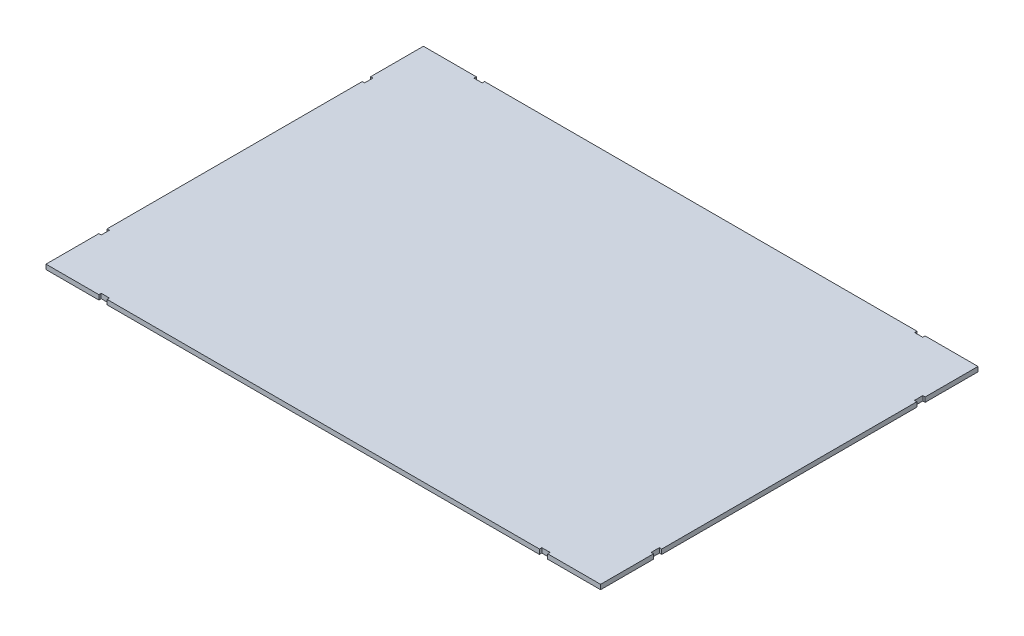
ISO-10303-21;
HEADER;
FILE_DESCRIPTION(('STEP AP214'),'2;1');
FILE_NAME('part.step','',(''),(''),'','','');
FILE_SCHEMA(('AUTOMOTIVE_DESIGN { 1 0 10303 214 1 1 1 1 }'));
ENDSEC;
DATA;
#1=APPLICATION_CONTEXT('core data for automotive mechanical design processes');
#2=APPLICATION_PROTOCOL_DEFINITION('international standard','automotive_design',2000,#1);
#3=PRODUCT_CONTEXT('',#1,'mechanical');
#4=PRODUCT('Part','Part','',(#3));
#5=PRODUCT_RELATED_PRODUCT_CATEGORY('part','',(#4));
#6=PRODUCT_DEFINITION_FORMATION('','',#4);
#7=PRODUCT_DEFINITION_CONTEXT('part definition',#1,'design');
#8=PRODUCT_DEFINITION('design','',#6,#7);
#9=PRODUCT_DEFINITION_SHAPE('','',#8);
#10=(LENGTH_UNIT() NAMED_UNIT(*) SI_UNIT(.MILLI.,.METRE.));
#11=(NAMED_UNIT(*) PLANE_ANGLE_UNIT() SI_UNIT($,.RADIAN.));
#12=(NAMED_UNIT(*) SI_UNIT($,.STERADIAN.) SOLID_ANGLE_UNIT());
#13=UNCERTAINTY_MEASURE_WITH_UNIT(LENGTH_MEASURE(1.E-05),#10,'distance_accuracy_value','');
#14=(GEOMETRIC_REPRESENTATION_CONTEXT(3) GLOBAL_UNCERTAINTY_ASSIGNED_CONTEXT((#13)) GLOBAL_UNIT_ASSIGNED_CONTEXT((#10,
#11,#12)) REPRESENTATION_CONTEXT('',''));
#15=CARTESIAN_POINT('',(0.,0.,0.));
#16=DIRECTION('',(0.,0.,1.));
#17=DIRECTION('',(1.,0.,0.));
#18=AXIS2_PLACEMENT_3D('',#15,#16,#17);
#19=CARTESIAN_POINT('',(469.5,8.,319.5));
#20=DIRECTION('',(-1.,0.,0.));
#21=DIRECTION('',(0.,0.,1.));
#22=AXIS2_PLACEMENT_3D('',#19,#20,#21);
#23=PLANE('',#22);
#24=DIRECTION('',(0.,0.,-1.));
#25=VECTOR('',#24,1.);
#26=CARTESIAN_POINT('',(469.5,0.,319.5));
#27=LINE('',#26,#25);
#28=CARTESIAN_POINT('',(469.5,0.,319.5));
#29=VERTEX_POINT('',#28);
#30=CARTESIAN_POINT('',(469.5,0.,230.));
#31=VERTEX_POINT('',#30);
#32=EDGE_CURVE('E487',#29,#31,#27,.T.);
#33=ORIENTED_EDGE('',*,*,#32,.T.);
#34=DIRECTION('',(0.,1.,0.));
#35=VECTOR('',#34,1.);
#36=CARTESIAN_POINT('',(469.5,8.,230.));
#37=LINE('',#36,#35);
#38=CARTESIAN_POINT('',(469.5,8.,230.));
#39=VERTEX_POINT('',#38);
#40=EDGE_CURVE('E278',#31,#39,#37,.T.);
#41=ORIENTED_EDGE('',*,*,#40,.T.);
#42=DIRECTION('',(0.,0.,-1.));
#43=VECTOR('',#42,1.);
#44=CARTESIAN_POINT('',(469.5,8.,319.5));
#45=LINE('',#44,#43);
#46=CARTESIAN_POINT('',(469.5,8.,319.5));
#47=VERTEX_POINT('',#46);
#48=EDGE_CURVE('E466',#47,#39,#45,.T.);
#49=ORIENTED_EDGE('',*,*,#48,.F.);
#50=DIRECTION('',(0.,-1.,0.));
#51=VECTOR('',#50,1.);
#52=CARTESIAN_POINT('',(469.5,8.,319.5));
#53=LINE('',#52,#51);
#54=EDGE_CURVE('E485',#47,#29,#53,.T.);
#55=ORIENTED_EDGE('',*,*,#54,.T.);
#56=EDGE_LOOP('',(#33,#41,#49,#55));
#57=FACE_BOUND('',#56,.T.);
#58=ADVANCED_FACE('F32',(#57),#23,.F.);
#59=CARTESIAN_POINT('',(469.5,8.,216.));
#60=VERTEX_POINT('',#59);
#61=CARTESIAN_POINT('',(469.5,8.,-216.));
#62=VERTEX_POINT('',#61);
#63=EDGE_CURVE('E470',#60,#62,#45,.T.);
#64=ORIENTED_EDGE('',*,*,#63,.F.);
#65=DIRECTION('',(0.,-1.,0.));
#66=VECTOR('',#65,1.);
#67=CARTESIAN_POINT('',(469.5,8.,216.));
#68=LINE('',#67,#66);
#69=CARTESIAN_POINT('',(469.5,0.,216.));
#70=VERTEX_POINT('',#69);
#71=EDGE_CURVE('E271',#60,#70,#68,.T.);
#72=ORIENTED_EDGE('',*,*,#71,.T.);
#73=CARTESIAN_POINT('',(469.5,0.,-216.));
#74=VERTEX_POINT('',#73);
#75=EDGE_CURVE('E490',#70,#74,#27,.T.);
#76=ORIENTED_EDGE('',*,*,#75,.T.);
#77=DIRECTION('',(0.,1.,0.));
#78=VECTOR('',#77,1.);
#79=CARTESIAN_POINT('',(469.5,8.,-216.));
#80=LINE('',#79,#78);
#81=EDGE_CURVE('E316',#74,#62,#80,.T.);
#82=ORIENTED_EDGE('',*,*,#81,.T.);
#83=EDGE_LOOP('',(#64,#72,#76,#82));
#84=FACE_BOUND('',#83,.T.);
#85=ADVANCED_FACE('F539',(#84),#23,.F.);
#86=CARTESIAN_POINT('',(-469.5,8.,319.5));
#87=DIRECTION('',(1.,0.,0.));
#88=DIRECTION('',(0.,0.,-1.));
#89=AXIS2_PLACEMENT_3D('',#86,#87,#88);
#90=PLANE('',#89);
#91=DIRECTION('',(0.,0.,1.));
#92=VECTOR('',#91,1.);
#93=CARTESIAN_POINT('',(-469.5,0.,319.5));
#94=LINE('',#93,#92);
#95=CARTESIAN_POINT('',(-469.5,0.,-319.5));
#96=VERTEX_POINT('',#95);
#97=CARTESIAN_POINT('',(-469.5,0.,-230.));
#98=VERTEX_POINT('',#97);
#99=EDGE_CURVE('E496',#96,#98,#94,.T.);
#100=ORIENTED_EDGE('',*,*,#99,.T.);
#101=DIRECTION('',(0.,1.,0.));
#102=VECTOR('',#101,1.);
#103=CARTESIAN_POINT('',(-469.5,8.,-230.));
#104=LINE('',#103,#102);
#105=CARTESIAN_POINT('',(-469.5,8.,-230.));
#106=VERTEX_POINT('',#105);
#107=EDGE_CURVE('E340',#98,#106,#104,.T.);
#108=ORIENTED_EDGE('',*,*,#107,.T.);
#109=DIRECTION('',(0.,0.,1.));
#110=VECTOR('',#109,1.);
#111=CARTESIAN_POINT('',(-469.5,8.,319.5));
#112=LINE('',#111,#110);
#113=CARTESIAN_POINT('',(-469.5,8.,-319.5));
#114=VERTEX_POINT('',#113);
#115=EDGE_CURVE('E477',#114,#106,#112,.T.);
#116=ORIENTED_EDGE('',*,*,#115,.F.);
#117=DIRECTION('',(0.,-1.,0.));
#118=VECTOR('',#117,1.);
#119=CARTESIAN_POINT('',(-469.5,8.,-319.5));
#120=LINE('',#119,#118);
#121=EDGE_CURVE('E510',#114,#96,#120,.T.);
#122=ORIENTED_EDGE('',*,*,#121,.T.);
#123=EDGE_LOOP('',(#100,#108,#116,#122));
#124=FACE_BOUND('',#123,.T.);
#125=ADVANCED_FACE('F579',(#124),#90,.F.);
#126=CARTESIAN_POINT('',(-469.5,8.,-319.5));
#127=DIRECTION('',(0.,0.,1.));
#128=DIRECTION('',(1.,0.,0.));
#129=AXIS2_PLACEMENT_3D('',#126,#127,#128);
#130=PLANE('',#129);
#131=DIRECTION('',(-1.,0.,0.));
#132=VECTOR('',#131,1.);
#133=CARTESIAN_POINT('',(-469.5,8.,-319.5));
#134=LINE('',#133,#132);
#135=CARTESIAN_POINT('',(366.,8.,-319.5));
#136=VERTEX_POINT('',#135);
#137=CARTESIAN_POINT('',(-366.,8.,-319.5));
#138=VERTEX_POINT('',#137);
#139=EDGE_CURVE('E476',#136,#138,#134,.T.);
#140=ORIENTED_EDGE('',*,*,#139,.F.);
#141=DIRECTION('',(0.,-1.,0.));
#142=VECTOR('',#141,1.);
#143=CARTESIAN_POINT('',(366.,8.,-319.5));
#144=LINE('',#143,#142);
#145=CARTESIAN_POINT('',(366.,0.,-319.5));
#146=VERTEX_POINT('',#145);
#147=EDGE_CURVE('E364',#136,#146,#144,.T.);
#148=ORIENTED_EDGE('',*,*,#147,.T.);
#149=DIRECTION('',(-1.,0.,0.));
#150=VECTOR('',#149,1.);
#151=CARTESIAN_POINT('',(-469.5,0.,-319.5));
#152=LINE('',#151,#150);
#153=CARTESIAN_POINT('',(-366.,0.,-319.5));
#154=VERTEX_POINT('',#153);
#155=EDGE_CURVE('E495',#146,#154,#152,.T.);
#156=ORIENTED_EDGE('',*,*,#155,.T.);
#157=DIRECTION('',(0.,1.,0.));
#158=VECTOR('',#157,1.);
#159=CARTESIAN_POINT('',(-366.,8.,-319.5));
#160=LINE('',#159,#158);
#161=EDGE_CURVE('E385',#154,#138,#160,.T.);
#162=ORIENTED_EDGE('',*,*,#161,.T.);
#163=EDGE_LOOP('',(#140,#148,#156,#162));
#164=FACE_BOUND('',#163,.T.);
#165=ADVANCED_FACE('F566',(#164),#130,.F.);
#166=CARTESIAN_POINT('',(-380.,8.,-319.5));
#167=VERTEX_POINT('',#166);
#168=EDGE_CURVE('E469',#167,#114,#134,.T.);
#169=ORIENTED_EDGE('',*,*,#168,.F.);
#170=DIRECTION('',(0.,-1.,0.));
#171=VECTOR('',#170,1.);
#172=CARTESIAN_POINT('',(-380.,8.,-319.5));
#173=LINE('',#172,#171);
#174=CARTESIAN_POINT('',(-380.,0.,-319.5));
#175=VERTEX_POINT('',#174);
#176=EDGE_CURVE('E389',#167,#175,#173,.T.);
#177=ORIENTED_EDGE('',*,*,#176,.T.);
#178=EDGE_CURVE('E489',#175,#96,#152,.T.);
#179=ORIENTED_EDGE('',*,*,#178,.T.);
#180=ORIENTED_EDGE('',*,*,#121,.F.);
#181=EDGE_LOOP('',(#169,#177,#179,#180));
#182=FACE_BOUND('',#181,.T.);
#183=ADVANCED_FACE('F575',(#182),#130,.F.);
#184=CARTESIAN_POINT('',(-469.5,8.,230.));
#185=VERTEX_POINT('',#184);
#186=CARTESIAN_POINT('',(-469.5,8.,319.5));
#187=VERTEX_POINT('',#186);
#188=EDGE_CURVE('E475',#185,#187,#112,.T.);
#189=ORIENTED_EDGE('',*,*,#188,.F.);
#190=DIRECTION('',(0.,-1.,0.));
#191=VECTOR('',#190,1.);
#192=CARTESIAN_POINT('',(-469.5,8.,230.));
#193=LINE('',#192,#191);
#194=CARTESIAN_POINT('',(-469.5,0.,230.));
#195=VERTEX_POINT('',#194);
#196=EDGE_CURVE('E414',#185,#195,#193,.T.);
#197=ORIENTED_EDGE('',*,*,#196,.T.);
#198=CARTESIAN_POINT('',(-469.5,0.,319.5));
#199=VERTEX_POINT('',#198);
#200=EDGE_CURVE('E494',#195,#199,#94,.T.);
#201=ORIENTED_EDGE('',*,*,#200,.T.);
#202=DIRECTION('',(0.,-1.,0.));
#203=VECTOR('',#202,1.);
#204=CARTESIAN_POINT('',(-469.5,8.,319.5));
#205=LINE('',#204,#203);
#206=EDGE_CURVE('E507',#187,#199,#205,.T.);
#207=ORIENTED_EDGE('',*,*,#206,.F.);
#208=EDGE_LOOP('',(#189,#197,#201,#207));
#209=FACE_BOUND('',#208,.T.);
#210=ADVANCED_FACE('F604',(#209),#90,.F.);
#211=CARTESIAN_POINT('',(-469.5,8.,319.5));
#212=DIRECTION('',(0.,0.,-1.));
#213=DIRECTION('',(-1.,0.,0.));
#214=AXIS2_PLACEMENT_3D('',#211,#212,#213);
#215=PLANE('',#214);
#216=DIRECTION('',(1.,0.,0.));
#217=VECTOR('',#216,1.);
#218=CARTESIAN_POINT('',(-469.5,8.,319.5));
#219=LINE('',#218,#217);
#220=CARTESIAN_POINT('',(380.,8.,319.5));
#221=VERTEX_POINT('',#220);
#222=EDGE_CURVE('E480',#221,#47,#219,.T.);
#223=ORIENTED_EDGE('',*,*,#222,.F.);
#224=DIRECTION('',(0.,-1.,0.));
#225=VECTOR('',#224,1.);
#226=CARTESIAN_POINT('',(380.,8.,319.5));
#227=LINE('',#226,#225);
#228=CARTESIAN_POINT('',(380.,0.,319.5));
#229=VERTEX_POINT('',#228);
#230=EDGE_CURVE('E438',#221,#229,#227,.T.);
#231=ORIENTED_EDGE('',*,*,#230,.T.);
#232=DIRECTION('',(1.,0.,0.));
#233=VECTOR('',#232,1.);
#234=CARTESIAN_POINT('',(-469.5,0.,319.5));
#235=LINE('',#234,#233);
#236=EDGE_CURVE('E499',#229,#29,#235,.T.);
#237=ORIENTED_EDGE('',*,*,#236,.T.);
#238=ORIENTED_EDGE('',*,*,#54,.F.);
#239=EDGE_LOOP('',(#223,#231,#237,#238));
#240=FACE_BOUND('',#239,.T.);
#241=ADVANCED_FACE('F632',(#240),#215,.F.);
#242=CARTESIAN_POINT('',(-366.,0.,319.5));
#243=VERTEX_POINT('',#242);
#244=CARTESIAN_POINT('',(366.,0.,319.5));
#245=VERTEX_POINT('',#244);
#246=EDGE_CURVE('E504',#243,#245,#235,.T.);
#247=ORIENTED_EDGE('',*,*,#246,.T.);
#248=DIRECTION('',(0.,1.,0.));
#249=VECTOR('',#248,1.);
#250=CARTESIAN_POINT('',(366.,8.,319.5));
#251=LINE('',#250,#249);
#252=CARTESIAN_POINT('',(366.,8.,319.5));
#253=VERTEX_POINT('',#252);
#254=EDGE_CURVE('E433',#245,#253,#251,.T.);
#255=ORIENTED_EDGE('',*,*,#254,.T.);
#256=CARTESIAN_POINT('',(-366.,8.,319.5));
#257=VERTEX_POINT('',#256);
#258=EDGE_CURVE('E486',#257,#253,#219,.T.);
#259=ORIENTED_EDGE('',*,*,#258,.F.);
#260=DIRECTION('',(0.,-1.,0.));
#261=VECTOR('',#260,1.);
#262=CARTESIAN_POINT('',(-366.,8.,319.5));
#263=LINE('',#262,#261);
#264=EDGE_CURVE('E462',#257,#243,#263,.T.);
#265=ORIENTED_EDGE('',*,*,#264,.T.);
#266=EDGE_LOOP('',(#247,#255,#259,#265));
#267=FACE_BOUND('',#266,.T.);
#268=ADVANCED_FACE('F625',(#267),#215,.F.);
#269=CARTESIAN_POINT('',(469.5,8.,-230.));
#270=VERTEX_POINT('',#269);
#271=CARTESIAN_POINT('',(469.5,8.,-319.5));
#272=VERTEX_POINT('',#271);
#273=EDGE_CURVE('E471',#270,#272,#45,.T.);
#274=ORIENTED_EDGE('',*,*,#273,.F.);
#275=DIRECTION('',(0.,-1.,0.));
#276=VECTOR('',#275,1.);
#277=CARTESIAN_POINT('',(469.5,8.,-230.));
#278=LINE('',#277,#276);
#279=CARTESIAN_POINT('',(469.5,0.,-230.));
#280=VERTEX_POINT('',#279);
#281=EDGE_CURVE('E312',#270,#280,#278,.T.);
#282=ORIENTED_EDGE('',*,*,#281,.T.);
#283=CARTESIAN_POINT('',(469.5,0.,-319.5));
#284=VERTEX_POINT('',#283);
#285=EDGE_CURVE('E465',#280,#284,#27,.T.);
#286=ORIENTED_EDGE('',*,*,#285,.T.);
#287=DIRECTION('',(0.,-1.,0.));
#288=VECTOR('',#287,1.);
#289=CARTESIAN_POINT('',(469.5,8.,-319.5));
#290=LINE('',#289,#288);
#291=EDGE_CURVE('E513',#272,#284,#290,.T.);
#292=ORIENTED_EDGE('',*,*,#291,.F.);
#293=EDGE_LOOP('',(#274,#282,#286,#292));
#294=FACE_BOUND('',#293,.T.);
#295=ADVANCED_FACE('F34',(#294),#23,.F.);
#296=CARTESIAN_POINT('',(380.,0.,-319.5));
#297=VERTEX_POINT('',#296);
#298=EDGE_CURVE('E491',#284,#297,#152,.T.);
#299=ORIENTED_EDGE('',*,*,#298,.T.);
#300=DIRECTION('',(0.,1.,0.));
#301=VECTOR('',#300,1.);
#302=CARTESIAN_POINT('',(380.,8.,-319.5));
#303=LINE('',#302,#301);
#304=CARTESIAN_POINT('',(380.,8.,-319.5));
#305=VERTEX_POINT('',#304);
#306=EDGE_CURVE('E360',#297,#305,#303,.T.);
#307=ORIENTED_EDGE('',*,*,#306,.T.);
#308=EDGE_CURVE('E472',#272,#305,#134,.T.);
#309=ORIENTED_EDGE('',*,*,#308,.F.);
#310=ORIENTED_EDGE('',*,*,#291,.T.);
#311=EDGE_LOOP('',(#299,#307,#309,#310));
#312=FACE_BOUND('',#311,.T.);
#313=ADVANCED_FACE('F551',(#312),#130,.F.);
#314=CARTESIAN_POINT('',(-469.5,8.,-216.));
#315=VERTEX_POINT('',#314);
#316=CARTESIAN_POINT('',(-469.5,8.,216.));
#317=VERTEX_POINT('',#316);
#318=EDGE_CURVE('E481',#315,#317,#112,.T.);
#319=ORIENTED_EDGE('',*,*,#318,.F.);
#320=DIRECTION('',(0.,-1.,0.));
#321=VECTOR('',#320,1.);
#322=CARTESIAN_POINT('',(-469.5,8.,-216.));
#323=LINE('',#322,#321);
#324=CARTESIAN_POINT('',(-469.5,0.,-216.));
#325=VERTEX_POINT('',#324);
#326=EDGE_CURVE('E335',#315,#325,#323,.T.);
#327=ORIENTED_EDGE('',*,*,#326,.T.);
#328=CARTESIAN_POINT('',(-469.5,0.,216.));
#329=VERTEX_POINT('',#328);
#330=EDGE_CURVE('E500',#325,#329,#94,.T.);
#331=ORIENTED_EDGE('',*,*,#330,.T.);
#332=DIRECTION('',(0.,1.,0.));
#333=VECTOR('',#332,1.);
#334=CARTESIAN_POINT('',(-469.5,8.,216.));
#335=LINE('',#334,#333);
#336=EDGE_CURVE('E410',#329,#317,#335,.T.);
#337=ORIENTED_EDGE('',*,*,#336,.T.);
#338=EDGE_LOOP('',(#319,#327,#331,#337));
#339=FACE_BOUND('',#338,.T.);
#340=ADVANCED_FACE('F595',(#339),#90,.F.);
#341=CARTESIAN_POINT('',(-380.,0.,319.5));
#342=VERTEX_POINT('',#341);
#343=EDGE_CURVE('E501',#199,#342,#235,.T.);
#344=ORIENTED_EDGE('',*,*,#343,.T.);
#345=DIRECTION('',(0.,1.,0.));
#346=VECTOR('',#345,1.);
#347=CARTESIAN_POINT('',(-380.,8.,319.5));
#348=LINE('',#347,#346);
#349=CARTESIAN_POINT('',(-380.,8.,319.5));
#350=VERTEX_POINT('',#349);
#351=EDGE_CURVE('E457',#342,#350,#348,.T.);
#352=ORIENTED_EDGE('',*,*,#351,.T.);
#353=EDGE_CURVE('E482',#187,#350,#219,.T.);
#354=ORIENTED_EDGE('',*,*,#353,.F.);
#355=ORIENTED_EDGE('',*,*,#206,.T.);
#356=EDGE_LOOP('',(#344,#352,#354,#355));
#357=FACE_BOUND('',#356,.T.);
#358=ADVANCED_FACE('F608',(#357),#215,.F.);
#359=CARTESIAN_POINT('',(0.,8.,0.));
#360=DIRECTION('',(0.,-1.,0.));
#361=DIRECTION('',(0.,0.,-1.));
#362=AXIS2_PLACEMENT_3D('',#359,#360,#361);
#363=PLANE('',#362);
#364=ORIENTED_EDGE('',*,*,#48,.T.);
#365=DIRECTION('',(1.,0.,0.));
#366=VECTOR('',#365,1.);
#367=CARTESIAN_POINT('',(473.5,8.,230.));
#368=LINE('',#367,#366);
#369=CARTESIAN_POINT('',(465.5,8.,230.));
#370=VERTEX_POINT('',#369);
#371=EDGE_CURVE('E286',#370,#39,#368,.T.);
#372=ORIENTED_EDGE('',*,*,#371,.F.);
#373=DIRECTION('',(0.,0.,1.));
#374=VECTOR('',#373,1.);
#375=CARTESIAN_POINT('',(465.5,8.,216.));
#376=LINE('',#375,#374);
#377=CARTESIAN_POINT('',(465.5,8.,216.));
#378=VERTEX_POINT('',#377);
#379=EDGE_CURVE('E268',#378,#370,#376,.T.);
#380=ORIENTED_EDGE('',*,*,#379,.F.);
#381=DIRECTION('',(-1.,0.,0.));
#382=VECTOR('',#381,1.);
#383=CARTESIAN_POINT('',(473.5,8.,216.));
#384=LINE('',#383,#382);
#385=EDGE_CURVE('E290',#60,#378,#384,.T.);
#386=ORIENTED_EDGE('',*,*,#385,.F.);
#387=ORIENTED_EDGE('',*,*,#63,.T.);
#388=DIRECTION('',(1.,0.,0.));
#389=VECTOR('',#388,1.);
#390=CARTESIAN_POINT('',(473.5,8.,-216.));
#391=LINE('',#390,#389);
#392=CARTESIAN_POINT('',(465.5,8.,-216.));
#393=VERTEX_POINT('',#392);
#394=EDGE_CURVE('E300',#393,#62,#391,.T.);
#395=ORIENTED_EDGE('',*,*,#394,.F.);
#396=DIRECTION('',(0.,0.,1.));
#397=VECTOR('',#396,1.);
#398=CARTESIAN_POINT('',(465.5,8.,-216.));
#399=LINE('',#398,#397);
#400=CARTESIAN_POINT('',(465.5,8.,-230.));
#401=VERTEX_POINT('',#400);
#402=EDGE_CURVE('E305',#401,#393,#399,.T.);
#403=ORIENTED_EDGE('',*,*,#402,.F.);
#404=DIRECTION('',(-1.,0.,0.));
#405=VECTOR('',#404,1.);
#406=CARTESIAN_POINT('',(473.5,8.,-230.));
#407=LINE('',#406,#405);
#408=EDGE_CURVE('E297',#270,#401,#407,.T.);
#409=ORIENTED_EDGE('',*,*,#408,.F.);
#410=ORIENTED_EDGE('',*,*,#273,.T.);
#411=ORIENTED_EDGE('',*,*,#308,.T.);
#412=DIRECTION('',(0.,0.,-1.));
#413=VECTOR('',#412,1.);
#414=CARTESIAN_POINT('',(380.,8.,-315.5));
#415=LINE('',#414,#413);
#416=CARTESIAN_POINT('',(380.,8.,-315.5));
#417=VERTEX_POINT('',#416);
#418=EDGE_CURVE('E354',#417,#305,#415,.T.);
#419=ORIENTED_EDGE('',*,*,#418,.F.);
#420=DIRECTION('',(1.,0.,0.));
#421=VECTOR('',#420,1.);
#422=CARTESIAN_POINT('',(380.,8.,-315.5));
#423=LINE('',#422,#421);
#424=CARTESIAN_POINT('',(366.,8.,-315.5));
#425=VERTEX_POINT('',#424);
#426=EDGE_CURVE('E343',#425,#417,#423,.T.);
#427=ORIENTED_EDGE('',*,*,#426,.F.);
#428=DIRECTION('',(0.,0.,1.));
#429=VECTOR('',#428,1.);
#430=CARTESIAN_POINT('',(366.,8.,-315.5));
#431=LINE('',#430,#429);
#432=EDGE_CURVE('E348',#136,#425,#431,.T.);
#433=ORIENTED_EDGE('',*,*,#432,.F.);
#434=ORIENTED_EDGE('',*,*,#139,.T.);
#435=DIRECTION('',(0.,0.,-1.));
#436=VECTOR('',#435,1.);
#437=CARTESIAN_POINT('',(-366.,8.,-315.5));
#438=LINE('',#437,#436);
#439=CARTESIAN_POINT('',(-366.,8.,-315.5));
#440=VERTEX_POINT('',#439);
#441=EDGE_CURVE('E378',#440,#138,#438,.T.);
#442=ORIENTED_EDGE('',*,*,#441,.F.);
#443=DIRECTION('',(1.,0.,0.));
#444=VECTOR('',#443,1.);
#445=CARTESIAN_POINT('',(-380.,8.,-315.5));
#446=LINE('',#445,#444);
#447=CARTESIAN_POINT('',(-380.,8.,-315.5));
#448=VERTEX_POINT('',#447);
#449=EDGE_CURVE('E367',#448,#440,#446,.T.);
#450=ORIENTED_EDGE('',*,*,#449,.F.);
#451=DIRECTION('',(0.,0.,1.));
#452=VECTOR('',#451,1.);
#453=CARTESIAN_POINT('',(-380.,8.,-315.5));
#454=LINE('',#453,#452);
#455=EDGE_CURVE('E372',#167,#448,#454,.T.);
#456=ORIENTED_EDGE('',*,*,#455,.F.);
#457=ORIENTED_EDGE('',*,*,#168,.T.);
#458=ORIENTED_EDGE('',*,*,#115,.T.);
#459=DIRECTION('',(-1.,0.,0.));
#460=VECTOR('',#459,1.);
#461=CARTESIAN_POINT('',(-473.5,8.,-230.));
#462=LINE('',#461,#460);
#463=CARTESIAN_POINT('',(-465.5,8.,-230.));
#464=VERTEX_POINT('',#463);
#465=EDGE_CURVE('E324',#464,#106,#462,.T.);
#466=ORIENTED_EDGE('',*,*,#465,.F.);
#467=DIRECTION('',(0.,0.,-1.));
#468=VECTOR('',#467,1.);
#469=CARTESIAN_POINT('',(-465.5,8.,-216.));
#470=LINE('',#469,#468);
#471=CARTESIAN_POINT('',(-465.5,8.,-216.));
#472=VERTEX_POINT('',#471);
#473=EDGE_CURVE('E329',#472,#464,#470,.T.);
#474=ORIENTED_EDGE('',*,*,#473,.F.);
#475=DIRECTION('',(1.,0.,0.));
#476=VECTOR('',#475,1.);
#477=CARTESIAN_POINT('',(-473.5,8.,-216.));
#478=LINE('',#477,#476);
#479=EDGE_CURVE('E319',#315,#472,#478,.T.);
#480=ORIENTED_EDGE('',*,*,#479,.F.);
#481=ORIENTED_EDGE('',*,*,#318,.T.);
#482=DIRECTION('',(-1.,0.,0.));
#483=VECTOR('',#482,1.);
#484=CARTESIAN_POINT('',(-473.5,8.,216.));
#485=LINE('',#484,#483);
#486=CARTESIAN_POINT('',(-465.5,8.,216.));
#487=VERTEX_POINT('',#486);
#488=EDGE_CURVE('E403',#487,#317,#485,.T.);
#489=ORIENTED_EDGE('',*,*,#488,.F.);
#490=DIRECTION('',(0.,0.,-1.));
#491=VECTOR('',#490,1.);
#492=CARTESIAN_POINT('',(-465.5,8.,216.));
#493=LINE('',#492,#491);
#494=CARTESIAN_POINT('',(-465.5,8.,230.));
#495=VERTEX_POINT('',#494);
#496=EDGE_CURVE('E392',#495,#487,#493,.T.);
#497=ORIENTED_EDGE('',*,*,#496,.F.);
#498=DIRECTION('',(1.,0.,0.));
#499=VECTOR('',#498,1.);
#500=CARTESIAN_POINT('',(-473.5,8.,230.));
#501=LINE('',#500,#499);
#502=EDGE_CURVE('E397',#185,#495,#501,.T.);
#503=ORIENTED_EDGE('',*,*,#502,.F.);
#504=ORIENTED_EDGE('',*,*,#188,.T.);
#505=ORIENTED_EDGE('',*,*,#353,.T.);
#506=DIRECTION('',(0.,0.,1.));
#507=VECTOR('',#506,1.);
#508=CARTESIAN_POINT('',(-380.,8.,315.5));
#509=LINE('',#508,#507);
#510=CARTESIAN_POINT('',(-380.,8.,315.5));
#511=VERTEX_POINT('',#510);
#512=EDGE_CURVE('E446',#511,#350,#509,.T.);
#513=ORIENTED_EDGE('',*,*,#512,.F.);
#514=DIRECTION('',(-1.,0.,0.));
#515=VECTOR('',#514,1.);
#516=CARTESIAN_POINT('',(-380.,8.,315.5));
#517=LINE('',#516,#515);
#518=CARTESIAN_POINT('',(-366.,8.,315.5));
#519=VERTEX_POINT('',#518);
#520=EDGE_CURVE('E451',#519,#511,#517,.T.);
#521=ORIENTED_EDGE('',*,*,#520,.F.);
#522=DIRECTION('',(0.,0.,-1.));
#523=VECTOR('',#522,1.);
#524=CARTESIAN_POINT('',(-366.,8.,315.5));
#525=LINE('',#524,#523);
#526=EDGE_CURVE('E441',#257,#519,#525,.T.);
#527=ORIENTED_EDGE('',*,*,#526,.F.);
#528=ORIENTED_EDGE('',*,*,#258,.T.);
#529=DIRECTION('',(0.,0.,1.));
#530=VECTOR('',#529,1.);
#531=CARTESIAN_POINT('',(366.,8.,315.5));
#532=LINE('',#531,#530);
#533=CARTESIAN_POINT('',(366.,8.,315.5));
#534=VERTEX_POINT('',#533);
#535=EDGE_CURVE('E422',#534,#253,#532,.T.);
#536=ORIENTED_EDGE('',*,*,#535,.F.);
#537=DIRECTION('',(-1.,0.,0.));
#538=VECTOR('',#537,1.);
#539=CARTESIAN_POINT('',(380.,8.,315.5));
#540=LINE('',#539,#538);
#541=CARTESIAN_POINT('',(380.,8.,315.5));
#542=VERTEX_POINT('',#541);
#543=EDGE_CURVE('E427',#542,#534,#540,.T.);
#544=ORIENTED_EDGE('',*,*,#543,.F.);
#545=DIRECTION('',(0.,0.,-1.));
#546=VECTOR('',#545,1.);
#547=CARTESIAN_POINT('',(380.,8.,315.5));
#548=LINE('',#547,#546);
#549=EDGE_CURVE('E417',#221,#542,#548,.T.);
#550=ORIENTED_EDGE('',*,*,#549,.F.);
#551=ORIENTED_EDGE('',*,*,#222,.T.);
#552=EDGE_LOOP('',(#364,#372,#380,#386,#387,#395,#403,#409,#410,#411,#419,#427,#433,#434,#442,
#450,#456,#457,#458,#466,#474,#480,#481,#489,#497,#503,#504,#505,#513,#521,#527,#528,#536,#544,
#550,#551));
#553=FACE_BOUND('',#552,.T.);
#554=ADVANCED_FACE('F546',(#553),#363,.F.);
#555=CARTESIAN_POINT('',(0.,0.,0.));
#556=DIRECTION('',(0.,-1.,0.));
#557=DIRECTION('',(0.,0.,-1.));
#558=AXIS2_PLACEMENT_3D('',#555,#556,#557);
#559=PLANE('',#558);
#560=DIRECTION('',(1.,0.,0.));
#561=VECTOR('',#560,1.);
#562=CARTESIAN_POINT('',(473.5,0.,230.));
#563=LINE('',#562,#561);
#564=CARTESIAN_POINT('',(465.5,0.,230.));
#565=VERTEX_POINT('',#564);
#566=EDGE_CURVE('E275',#565,#31,#563,.T.);
#567=ORIENTED_EDGE('',*,*,#566,.T.);
#568=ORIENTED_EDGE('',*,*,#32,.F.);
#569=ORIENTED_EDGE('',*,*,#236,.F.);
#570=DIRECTION('',(0.,0.,1.));
#571=VECTOR('',#570,1.);
#572=CARTESIAN_POINT('',(380.,0.,0.));
#573=LINE('',#572,#571);
#574=CARTESIAN_POINT('',(380.,0.,315.5));
#575=VERTEX_POINT('',#574);
#576=EDGE_CURVE('E518',#575,#229,#573,.T.);
#577=ORIENTED_EDGE('',*,*,#576,.F.);
#578=DIRECTION('',(-1.,0.,0.));
#579=VECTOR('',#578,1.);
#580=CARTESIAN_POINT('',(380.,0.,315.5));
#581=LINE('',#580,#579);
#582=CARTESIAN_POINT('',(366.,0.,315.5));
#583=VERTEX_POINT('',#582);
#584=EDGE_CURVE('E418',#575,#583,#581,.T.);
#585=ORIENTED_EDGE('',*,*,#584,.T.);
#586=DIRECTION('',(0.,0.,1.));
#587=VECTOR('',#586,1.);
#588=CARTESIAN_POINT('',(366.,0.,315.5));
#589=LINE('',#588,#587);
#590=EDGE_CURVE('E421',#583,#245,#589,.T.);
#591=ORIENTED_EDGE('',*,*,#590,.T.);
#592=ORIENTED_EDGE('',*,*,#246,.F.);
#593=DIRECTION('',(0.,0.,1.));
#594=VECTOR('',#593,1.);
#595=CARTESIAN_POINT('',(-366.,0.,0.));
#596=LINE('',#595,#594);
#597=CARTESIAN_POINT('',(-366.,0.,315.5));
#598=VERTEX_POINT('',#597);
#599=EDGE_CURVE('E516',#598,#243,#596,.T.);
#600=ORIENTED_EDGE('',*,*,#599,.F.);
#601=DIRECTION('',(-1.,0.,0.));
#602=VECTOR('',#601,1.);
#603=CARTESIAN_POINT('',(-380.,0.,315.5));
#604=LINE('',#603,#602);
#605=CARTESIAN_POINT('',(-380.,0.,315.5));
#606=VERTEX_POINT('',#605);
#607=EDGE_CURVE('E442',#598,#606,#604,.T.);
#608=ORIENTED_EDGE('',*,*,#607,.T.);
#609=DIRECTION('',(0.,0.,1.));
#610=VECTOR('',#609,1.);
#611=CARTESIAN_POINT('',(-380.,0.,315.5));
#612=LINE('',#611,#610);
#613=EDGE_CURVE('E445',#606,#342,#612,.T.);
#614=ORIENTED_EDGE('',*,*,#613,.T.);
#615=ORIENTED_EDGE('',*,*,#343,.F.);
#616=ORIENTED_EDGE('',*,*,#200,.F.);
#617=DIRECTION('',(-1.,0.,0.));
#618=VECTOR('',#617,1.);
#619=CARTESIAN_POINT('',(0.,0.,230.));
#620=LINE('',#619,#618);
#621=CARTESIAN_POINT('',(-465.5,0.,230.));
#622=VERTEX_POINT('',#621);
#623=EDGE_CURVE('E520',#622,#195,#620,.T.);
#624=ORIENTED_EDGE('',*,*,#623,.F.);
#625=DIRECTION('',(0.,0.,-1.));
#626=VECTOR('',#625,1.);
#627=CARTESIAN_POINT('',(-465.5,0.,216.));
#628=LINE('',#627,#626);
#629=CARTESIAN_POINT('',(-465.5,0.,216.));
#630=VERTEX_POINT('',#629);
#631=EDGE_CURVE('E393',#622,#630,#628,.T.);
#632=ORIENTED_EDGE('',*,*,#631,.T.);
#633=DIRECTION('',(-1.,0.,0.));
#634=VECTOR('',#633,1.);
#635=CARTESIAN_POINT('',(-473.5,0.,216.));
#636=LINE('',#635,#634);
#637=EDGE_CURVE('E396',#630,#329,#636,.T.);
#638=ORIENTED_EDGE('',*,*,#637,.T.);
#639=ORIENTED_EDGE('',*,*,#330,.F.);
#640=DIRECTION('',(-1.,0.,0.));
#641=VECTOR('',#640,1.);
#642=CARTESIAN_POINT('',(0.,0.,-216.));
#643=LINE('',#642,#641);
#644=CARTESIAN_POINT('',(-465.5,0.,-216.));
#645=VERTEX_POINT('',#644);
#646=EDGE_CURVE('E526',#645,#325,#643,.T.);
#647=ORIENTED_EDGE('',*,*,#646,.F.);
#648=DIRECTION('',(0.,0.,-1.));
#649=VECTOR('',#648,1.);
#650=CARTESIAN_POINT('',(-465.5,0.,-216.));
#651=LINE('',#650,#649);
#652=CARTESIAN_POINT('',(-465.5,0.,-230.));
#653=VERTEX_POINT('',#652);
#654=EDGE_CURVE('E320',#645,#653,#651,.T.);
#655=ORIENTED_EDGE('',*,*,#654,.T.);
#656=DIRECTION('',(-1.,0.,0.));
#657=VECTOR('',#656,1.);
#658=CARTESIAN_POINT('',(-473.5,0.,-230.));
#659=LINE('',#658,#657);
#660=EDGE_CURVE('E323',#653,#98,#659,.T.);
#661=ORIENTED_EDGE('',*,*,#660,.T.);
#662=ORIENTED_EDGE('',*,*,#99,.F.);
#663=ORIENTED_EDGE('',*,*,#178,.F.);
#664=DIRECTION('',(0.,0.,-1.));
#665=VECTOR('',#664,1.);
#666=CARTESIAN_POINT('',(-380.,0.,0.));
#667=LINE('',#666,#665);
#668=CARTESIAN_POINT('',(-380.,0.,-315.5));
#669=VERTEX_POINT('',#668);
#670=EDGE_CURVE('E522',#669,#175,#667,.T.);
#671=ORIENTED_EDGE('',*,*,#670,.F.);
#672=DIRECTION('',(1.,0.,0.));
#673=VECTOR('',#672,1.);
#674=CARTESIAN_POINT('',(-380.,0.,-315.5));
#675=LINE('',#674,#673);
#676=CARTESIAN_POINT('',(-366.,0.,-315.5));
#677=VERTEX_POINT('',#676);
#678=EDGE_CURVE('E368',#669,#677,#675,.T.);
#679=ORIENTED_EDGE('',*,*,#678,.T.);
#680=DIRECTION('',(0.,0.,-1.));
#681=VECTOR('',#680,1.);
#682=CARTESIAN_POINT('',(-366.,0.,-315.5));
#683=LINE('',#682,#681);
#684=EDGE_CURVE('E371',#677,#154,#683,.T.);
#685=ORIENTED_EDGE('',*,*,#684,.T.);
#686=ORIENTED_EDGE('',*,*,#155,.F.);
#687=DIRECTION('',(0.,0.,-1.));
#688=VECTOR('',#687,1.);
#689=CARTESIAN_POINT('',(366.,0.,0.));
#690=LINE('',#689,#688);
#691=CARTESIAN_POINT('',(366.,0.,-315.5));
#692=VERTEX_POINT('',#691);
#693=EDGE_CURVE('E524',#692,#146,#690,.T.);
#694=ORIENTED_EDGE('',*,*,#693,.F.);
#695=DIRECTION('',(1.,0.,0.));
#696=VECTOR('',#695,1.);
#697=CARTESIAN_POINT('',(380.,0.,-315.5));
#698=LINE('',#697,#696);
#699=CARTESIAN_POINT('',(380.,0.,-315.5));
#700=VERTEX_POINT('',#699);
#701=EDGE_CURVE('E344',#692,#700,#698,.T.);
#702=ORIENTED_EDGE('',*,*,#701,.T.);
#703=DIRECTION('',(0.,0.,-1.));
#704=VECTOR('',#703,1.);
#705=CARTESIAN_POINT('',(380.,0.,-315.5));
#706=LINE('',#705,#704);
#707=EDGE_CURVE('E347',#700,#297,#706,.T.);
#708=ORIENTED_EDGE('',*,*,#707,.T.);
#709=ORIENTED_EDGE('',*,*,#298,.F.);
#710=ORIENTED_EDGE('',*,*,#285,.F.);
#711=DIRECTION('',(1.,0.,0.));
#712=VECTOR('',#711,1.);
#713=CARTESIAN_POINT('',(0.,0.,-230.));
#714=LINE('',#713,#712);
#715=CARTESIAN_POINT('',(465.5,0.,-230.));
#716=VERTEX_POINT('',#715);
#717=EDGE_CURVE('E40',#716,#280,#714,.T.);
#718=ORIENTED_EDGE('',*,*,#717,.F.);
#719=DIRECTION('',(0.,0.,1.));
#720=VECTOR('',#719,1.);
#721=CARTESIAN_POINT('',(465.5,0.,-216.));
#722=LINE('',#721,#720);
#723=CARTESIAN_POINT('',(465.5,0.,-216.));
#724=VERTEX_POINT('',#723);
#725=EDGE_CURVE('E55',#716,#724,#722,.T.);
#726=ORIENTED_EDGE('',*,*,#725,.T.);
#727=DIRECTION('',(1.,0.,0.));
#728=VECTOR('',#727,1.);
#729=CARTESIAN_POINT('',(473.5,0.,-216.));
#730=LINE('',#729,#728);
#731=EDGE_CURVE('E299',#724,#74,#730,.T.);
#732=ORIENTED_EDGE('',*,*,#731,.T.);
#733=ORIENTED_EDGE('',*,*,#75,.F.);
#734=DIRECTION('',(1.,0.,0.));
#735=VECTOR('',#734,1.);
#736=CARTESIAN_POINT('',(0.,0.,216.));
#737=LINE('',#736,#735);
#738=CARTESIAN_POINT('',(465.5,0.,216.));
#739=VERTEX_POINT('',#738);
#740=EDGE_CURVE('E11',#739,#70,#737,.T.);
#741=ORIENTED_EDGE('',*,*,#740,.F.);
#742=DIRECTION('',(0.,0.,1.));
#743=VECTOR('',#742,1.);
#744=CARTESIAN_POINT('',(465.5,0.,216.));
#745=LINE('',#744,#743);
#746=EDGE_CURVE('E47',#739,#565,#745,.T.);
#747=ORIENTED_EDGE('',*,*,#746,.T.);
#748=EDGE_LOOP('',(#567,#568,#569,#577,#585,#591,#592,#600,#608,#614,#615,#616,#624,#632,#638,
#639,#647,#655,#661,#662,#663,#671,#679,#685,#686,#694,#702,#708,#709,#710,#718,#726,#732,#733,
#741,#747));
#749=FACE_BOUND('',#748,.T.);
#750=ADVANCED_FACE('F284',(#749),#559,.T.);
#751=CARTESIAN_POINT('',(-366.,0.,315.5));
#752=DIRECTION('',(1.,0.,0.));
#753=DIRECTION('',(0.,0.,-1.));
#754=AXIS2_PLACEMENT_3D('',#751,#752,#753);
#755=PLANE('',#754);
#756=ORIENTED_EDGE('',*,*,#526,.T.);
#757=DIRECTION('',(0.,1.,0.));
#758=VECTOR('',#757,1.);
#759=CARTESIAN_POINT('',(-366.,0.,315.5));
#760=LINE('',#759,#758);
#761=EDGE_CURVE('E449',#598,#519,#760,.T.);
#762=ORIENTED_EDGE('',*,*,#761,.F.);
#763=ORIENTED_EDGE('',*,*,#599,.T.);
#764=ORIENTED_EDGE('',*,*,#264,.F.);
#765=EDGE_LOOP('',(#756,#762,#763,#764));
#766=FACE_BOUND('',#765,.T.);
#767=ADVANCED_FACE('F704',(#766),#755,.F.);
#768=CARTESIAN_POINT('',(-380.,0.,315.5));
#769=DIRECTION('',(-1.,0.,0.));
#770=DIRECTION('',(0.,0.,1.));
#771=AXIS2_PLACEMENT_3D('',#768,#769,#770);
#772=PLANE('',#771);
#773=ORIENTED_EDGE('',*,*,#613,.F.);
#774=DIRECTION('',(0.,1.,0.));
#775=VECTOR('',#774,1.);
#776=CARTESIAN_POINT('',(-380.,0.,315.5));
#777=LINE('',#776,#775);
#778=EDGE_CURVE('E455',#606,#511,#777,.T.);
#779=ORIENTED_EDGE('',*,*,#778,.T.);
#780=ORIENTED_EDGE('',*,*,#512,.T.);
#781=ORIENTED_EDGE('',*,*,#351,.F.);
#782=EDGE_LOOP('',(#773,#779,#780,#781));
#783=FACE_BOUND('',#782,.T.);
#784=ADVANCED_FACE('F610',(#783),#772,.F.);
#785=CARTESIAN_POINT('',(-380.,0.,315.5));
#786=DIRECTION('',(0.,0.,-1.));
#787=DIRECTION('',(-1.,0.,0.));
#788=AXIS2_PLACEMENT_3D('',#785,#786,#787);
#789=PLANE('',#788);
#790=ORIENTED_EDGE('',*,*,#520,.T.);
#791=ORIENTED_EDGE('',*,*,#778,.F.);
#792=ORIENTED_EDGE('',*,*,#607,.F.);
#793=ORIENTED_EDGE('',*,*,#761,.T.);
#794=EDGE_LOOP('',(#790,#791,#792,#793));
#795=FACE_BOUND('',#794,.T.);
#796=ADVANCED_FACE('F616',(#795),#789,.F.);
#797=CARTESIAN_POINT('',(380.,0.,315.5));
#798=DIRECTION('',(1.,0.,0.));
#799=DIRECTION('',(0.,0.,-1.));
#800=AXIS2_PLACEMENT_3D('',#797,#798,#799);
#801=PLANE('',#800);
#802=ORIENTED_EDGE('',*,*,#549,.T.);
#803=DIRECTION('',(0.,1.,0.));
#804=VECTOR('',#803,1.);
#805=CARTESIAN_POINT('',(380.,0.,315.5));
#806=LINE('',#805,#804);
#807=EDGE_CURVE('E425',#575,#542,#806,.T.);
#808=ORIENTED_EDGE('',*,*,#807,.F.);
#809=ORIENTED_EDGE('',*,*,#576,.T.);
#810=ORIENTED_EDGE('',*,*,#230,.F.);
#811=EDGE_LOOP('',(#802,#808,#809,#810));
#812=FACE_BOUND('',#811,.T.);
#813=ADVANCED_FACE('F643',(#812),#801,.F.);
#814=CARTESIAN_POINT('',(366.,0.,315.5));
#815=DIRECTION('',(-1.,0.,0.));
#816=DIRECTION('',(0.,0.,1.));
#817=AXIS2_PLACEMENT_3D('',#814,#815,#816);
#818=PLANE('',#817);
#819=ORIENTED_EDGE('',*,*,#590,.F.);
#820=DIRECTION('',(0.,1.,0.));
#821=VECTOR('',#820,1.);
#822=CARTESIAN_POINT('',(366.,0.,315.5));
#823=LINE('',#822,#821);
#824=EDGE_CURVE('E431',#583,#534,#823,.T.);
#825=ORIENTED_EDGE('',*,*,#824,.T.);
#826=ORIENTED_EDGE('',*,*,#535,.T.);
#827=ORIENTED_EDGE('',*,*,#254,.F.);
#828=EDGE_LOOP('',(#819,#825,#826,#827));
#829=FACE_BOUND('',#828,.T.);
#830=ADVANCED_FACE('F639',(#829),#818,.F.);
#831=CARTESIAN_POINT('',(380.,0.,315.5));
#832=DIRECTION('',(0.,0.,-1.));
#833=DIRECTION('',(-1.,0.,0.));
#834=AXIS2_PLACEMENT_3D('',#831,#832,#833);
#835=PLANE('',#834);
#836=ORIENTED_EDGE('',*,*,#543,.T.);
#837=ORIENTED_EDGE('',*,*,#824,.F.);
#838=ORIENTED_EDGE('',*,*,#584,.F.);
#839=ORIENTED_EDGE('',*,*,#807,.T.);
#840=EDGE_LOOP('',(#836,#837,#838,#839));
#841=FACE_BOUND('',#840,.T.);
#842=ADVANCED_FACE('F641',(#841),#835,.F.);
#843=CARTESIAN_POINT('',(-473.5,0.,230.));
#844=DIRECTION('',(0.,0.,1.));
#845=DIRECTION('',(1.,0.,0.));
#846=AXIS2_PLACEMENT_3D('',#843,#844,#845);
#847=PLANE('',#846);
#848=ORIENTED_EDGE('',*,*,#502,.T.);
#849=DIRECTION('',(0.,1.,0.));
#850=VECTOR('',#849,1.);
#851=CARTESIAN_POINT('',(-465.5,0.,230.));
#852=LINE('',#851,#850);
#853=EDGE_CURVE('E407',#622,#495,#852,.T.);
#854=ORIENTED_EDGE('',*,*,#853,.F.);
#855=ORIENTED_EDGE('',*,*,#623,.T.);
#856=ORIENTED_EDGE('',*,*,#196,.F.);
#857=EDGE_LOOP('',(#848,#854,#855,#856));
#858=FACE_BOUND('',#857,.T.);
#859=ADVANCED_FACE('F738',(#858),#847,.F.);
#860=CARTESIAN_POINT('',(-473.5,0.,216.));
#861=DIRECTION('',(0.,0.,-1.));
#862=DIRECTION('',(-1.,0.,0.));
#863=AXIS2_PLACEMENT_3D('',#860,#861,#862);
#864=PLANE('',#863);
#865=ORIENTED_EDGE('',*,*,#637,.F.);
#866=DIRECTION('',(0.,1.,0.));
#867=VECTOR('',#866,1.);
#868=CARTESIAN_POINT('',(-465.5,0.,216.));
#869=LINE('',#868,#867);
#870=EDGE_CURVE('E400',#630,#487,#869,.T.);
#871=ORIENTED_EDGE('',*,*,#870,.T.);
#872=ORIENTED_EDGE('',*,*,#488,.T.);
#873=ORIENTED_EDGE('',*,*,#336,.F.);
#874=EDGE_LOOP('',(#865,#871,#872,#873));
#875=FACE_BOUND('',#874,.T.);
#876=ADVANCED_FACE('F745',(#875),#864,.F.);
#877=CARTESIAN_POINT('',(-465.5,0.,216.));
#878=DIRECTION('',(1.,0.,0.));
#879=DIRECTION('',(0.,0.,-1.));
#880=AXIS2_PLACEMENT_3D('',#877,#878,#879);
#881=PLANE('',#880);
#882=ORIENTED_EDGE('',*,*,#496,.T.);
#883=ORIENTED_EDGE('',*,*,#870,.F.);
#884=ORIENTED_EDGE('',*,*,#631,.F.);
#885=ORIENTED_EDGE('',*,*,#853,.T.);
#886=EDGE_LOOP('',(#882,#883,#884,#885));
#887=FACE_BOUND('',#886,.T.);
#888=ADVANCED_FACE('F754',(#887),#881,.F.);
#889=CARTESIAN_POINT('',(-380.,0.,-315.5));
#890=DIRECTION('',(-1.,0.,0.));
#891=DIRECTION('',(0.,0.,1.));
#892=AXIS2_PLACEMENT_3D('',#889,#890,#891);
#893=PLANE('',#892);
#894=ORIENTED_EDGE('',*,*,#455,.T.);
#895=DIRECTION('',(0.,1.,0.));
#896=VECTOR('',#895,1.);
#897=CARTESIAN_POINT('',(-380.,0.,-315.5));
#898=LINE('',#897,#896);
#899=EDGE_CURVE('E382',#669,#448,#898,.T.);
#900=ORIENTED_EDGE('',*,*,#899,.F.);
#901=ORIENTED_EDGE('',*,*,#670,.T.);
#902=ORIENTED_EDGE('',*,*,#176,.F.);
#903=EDGE_LOOP('',(#894,#900,#901,#902));
#904=FACE_BOUND('',#903,.T.);
#905=ADVANCED_FACE('F763',(#904),#893,.F.);
#906=CARTESIAN_POINT('',(-366.,0.,-315.5));
#907=DIRECTION('',(1.,0.,0.));
#908=DIRECTION('',(0.,0.,-1.));
#909=AXIS2_PLACEMENT_3D('',#906,#907,#908);
#910=PLANE('',#909);
#911=ORIENTED_EDGE('',*,*,#684,.F.);
#912=DIRECTION('',(0.,1.,0.));
#913=VECTOR('',#912,1.);
#914=CARTESIAN_POINT('',(-366.,0.,-315.5));
#915=LINE('',#914,#913);
#916=EDGE_CURVE('E375',#677,#440,#915,.T.);
#917=ORIENTED_EDGE('',*,*,#916,.T.);
#918=ORIENTED_EDGE('',*,*,#441,.T.);
#919=ORIENTED_EDGE('',*,*,#161,.F.);
#920=EDGE_LOOP('',(#911,#917,#918,#919));
#921=FACE_BOUND('',#920,.T.);
#922=ADVANCED_FACE('F772',(#921),#910,.F.);
#923=CARTESIAN_POINT('',(-380.,0.,-315.5));
#924=DIRECTION('',(0.,0.,1.));
#925=DIRECTION('',(1.,0.,0.));
#926=AXIS2_PLACEMENT_3D('',#923,#924,#925);
#927=PLANE('',#926);
#928=ORIENTED_EDGE('',*,*,#449,.T.);
#929=ORIENTED_EDGE('',*,*,#916,.F.);
#930=ORIENTED_EDGE('',*,*,#678,.F.);
#931=ORIENTED_EDGE('',*,*,#899,.T.);
#932=EDGE_LOOP('',(#928,#929,#930,#931));
#933=FACE_BOUND('',#932,.T.);
#934=ADVANCED_FACE('F781',(#933),#927,.F.);
#935=CARTESIAN_POINT('',(366.,0.,-315.5));
#936=DIRECTION('',(-1.,0.,0.));
#937=DIRECTION('',(0.,0.,1.));
#938=AXIS2_PLACEMENT_3D('',#935,#936,#937);
#939=PLANE('',#938);
#940=ORIENTED_EDGE('',*,*,#432,.T.);
#941=DIRECTION('',(0.,1.,0.));
#942=VECTOR('',#941,1.);
#943=CARTESIAN_POINT('',(366.,0.,-315.5));
#944=LINE('',#943,#942);
#945=EDGE_CURVE('E357',#692,#425,#944,.T.);
#946=ORIENTED_EDGE('',*,*,#945,.F.);
#947=ORIENTED_EDGE('',*,*,#693,.T.);
#948=ORIENTED_EDGE('',*,*,#147,.F.);
#949=EDGE_LOOP('',(#940,#946,#947,#948));
#950=FACE_BOUND('',#949,.T.);
#951=ADVANCED_FACE('F790',(#950),#939,.F.);
#952=CARTESIAN_POINT('',(380.,0.,-315.5));
#953=DIRECTION('',(1.,0.,0.));
#954=DIRECTION('',(0.,0.,-1.));
#955=AXIS2_PLACEMENT_3D('',#952,#953,#954);
#956=PLANE('',#955);
#957=ORIENTED_EDGE('',*,*,#707,.F.);
#958=DIRECTION('',(0.,1.,0.));
#959=VECTOR('',#958,1.);
#960=CARTESIAN_POINT('',(380.,0.,-315.5));
#961=LINE('',#960,#959);
#962=EDGE_CURVE('E351',#700,#417,#961,.T.);
#963=ORIENTED_EDGE('',*,*,#962,.T.);
#964=ORIENTED_EDGE('',*,*,#418,.T.);
#965=ORIENTED_EDGE('',*,*,#306,.F.);
#966=EDGE_LOOP('',(#957,#963,#964,#965));
#967=FACE_BOUND('',#966,.T.);
#968=ADVANCED_FACE('F554',(#967),#956,.F.);
#969=CARTESIAN_POINT('',(380.,0.,-315.5));
#970=DIRECTION('',(0.,0.,1.));
#971=DIRECTION('',(1.,0.,0.));
#972=AXIS2_PLACEMENT_3D('',#969,#970,#971);
#973=PLANE('',#972);
#974=ORIENTED_EDGE('',*,*,#426,.T.);
#975=ORIENTED_EDGE('',*,*,#962,.F.);
#976=ORIENTED_EDGE('',*,*,#701,.F.);
#977=ORIENTED_EDGE('',*,*,#945,.T.);
#978=EDGE_LOOP('',(#974,#975,#976,#977));
#979=FACE_BOUND('',#978,.T.);
#980=ADVANCED_FACE('F559',(#979),#973,.F.);
#981=CARTESIAN_POINT('',(-473.5,0.,-230.));
#982=DIRECTION('',(0.,0.,-1.));
#983=DIRECTION('',(-1.,0.,0.));
#984=AXIS2_PLACEMENT_3D('',#981,#982,#983);
#985=PLANE('',#984);
#986=ORIENTED_EDGE('',*,*,#660,.F.);
#987=DIRECTION('',(0.,1.,0.));
#988=VECTOR('',#987,1.);
#989=CARTESIAN_POINT('',(-465.5,0.,-230.));
#990=LINE('',#989,#988);
#991=EDGE_CURVE('E333',#653,#464,#990,.T.);
#992=ORIENTED_EDGE('',*,*,#991,.T.);
#993=ORIENTED_EDGE('',*,*,#465,.T.);
#994=ORIENTED_EDGE('',*,*,#107,.F.);
#995=EDGE_LOOP('',(#986,#992,#993,#994));
#996=FACE_BOUND('',#995,.T.);
#997=ADVANCED_FACE('F582',(#996),#985,.F.);
#998=CARTESIAN_POINT('',(-473.5,0.,-216.));
#999=DIRECTION('',(0.,0.,1.));
#1000=DIRECTION('',(1.,0.,0.));
#1001=AXIS2_PLACEMENT_3D('',#998,#999,#1000);
#1002=PLANE('',#1001);
#1003=ORIENTED_EDGE('',*,*,#479,.T.);
#1004=DIRECTION('',(0.,1.,0.));
#1005=VECTOR('',#1004,1.);
#1006=CARTESIAN_POINT('',(-465.5,0.,-216.));
#1007=LINE('',#1006,#1005);
#1008=EDGE_CURVE('E327',#645,#472,#1007,.T.);
#1009=ORIENTED_EDGE('',*,*,#1008,.F.);
#1010=ORIENTED_EDGE('',*,*,#646,.T.);
#1011=ORIENTED_EDGE('',*,*,#326,.F.);
#1012=EDGE_LOOP('',(#1003,#1009,#1010,#1011));
#1013=FACE_BOUND('',#1012,.T.);
#1014=ADVANCED_FACE('F590',(#1013),#1002,.F.);
#1015=CARTESIAN_POINT('',(-465.5,0.,-216.));
#1016=DIRECTION('',(1.,0.,0.));
#1017=DIRECTION('',(0.,0.,-1.));
#1018=AXIS2_PLACEMENT_3D('',#1015,#1016,#1017);
#1019=PLANE('',#1018);
#1020=ORIENTED_EDGE('',*,*,#473,.T.);
#1021=ORIENTED_EDGE('',*,*,#991,.F.);
#1022=ORIENTED_EDGE('',*,*,#654,.F.);
#1023=ORIENTED_EDGE('',*,*,#1008,.T.);
#1024=EDGE_LOOP('',(#1020,#1021,#1022,#1023));
#1025=FACE_BOUND('',#1024,.T.);
#1026=ADVANCED_FACE('F587',(#1025),#1019,.F.);
#1027=CARTESIAN_POINT('',(473.5,0.,-216.));
#1028=DIRECTION('',(0.,0.,1.));
#1029=DIRECTION('',(1.,0.,0.));
#1030=AXIS2_PLACEMENT_3D('',#1027,#1028,#1029);
#1031=PLANE('',#1030);
#1032=ORIENTED_EDGE('',*,*,#731,.F.);
#1033=DIRECTION('',(0.,1.,0.));
#1034=VECTOR('',#1033,1.);
#1035=CARTESIAN_POINT('',(465.5,0.,-216.));
#1036=LINE('',#1035,#1034);
#1037=EDGE_CURVE('E310',#724,#393,#1036,.T.);
#1038=ORIENTED_EDGE('',*,*,#1037,.T.);
#1039=ORIENTED_EDGE('',*,*,#394,.T.);
#1040=ORIENTED_EDGE('',*,*,#81,.F.);
#1041=EDGE_LOOP('',(#1032,#1038,#1039,#1040));
#1042=FACE_BOUND('',#1041,.T.);
#1043=ADVANCED_FACE('F542',(#1042),#1031,.F.);
#1044=CARTESIAN_POINT('',(473.5,0.,-230.));
#1045=DIRECTION('',(0.,0.,-1.));
#1046=DIRECTION('',(-1.,0.,0.));
#1047=AXIS2_PLACEMENT_3D('',#1044,#1045,#1046);
#1048=PLANE('',#1047);
#1049=ORIENTED_EDGE('',*,*,#408,.T.);
#1050=DIRECTION('',(0.,1.,0.));
#1051=VECTOR('',#1050,1.);
#1052=CARTESIAN_POINT('',(465.5,0.,-230.));
#1053=LINE('',#1052,#1051);
#1054=EDGE_CURVE('E303',#716,#401,#1053,.T.);
#1055=ORIENTED_EDGE('',*,*,#1054,.F.);
#1056=ORIENTED_EDGE('',*,*,#717,.T.);
#1057=ORIENTED_EDGE('',*,*,#281,.F.);
#1058=EDGE_LOOP('',(#1049,#1055,#1056,#1057));
#1059=FACE_BOUND('',#1058,.T.);
#1060=ADVANCED_FACE('F529',(#1059),#1048,.F.);
#1061=CARTESIAN_POINT('',(465.5,0.,-216.));
#1062=DIRECTION('',(-1.,0.,0.));
#1063=DIRECTION('',(0.,0.,1.));
#1064=AXIS2_PLACEMENT_3D('',#1061,#1062,#1063);
#1065=PLANE('',#1064);
#1066=ORIENTED_EDGE('',*,*,#402,.T.);
#1067=ORIENTED_EDGE('',*,*,#1037,.F.);
#1068=ORIENTED_EDGE('',*,*,#725,.F.);
#1069=ORIENTED_EDGE('',*,*,#1054,.T.);
#1070=EDGE_LOOP('',(#1066,#1067,#1068,#1069));
#1071=FACE_BOUND('',#1070,.T.);
#1072=ADVANCED_FACE('F848',(#1071),#1065,.F.);
#1073=CARTESIAN_POINT('',(473.5,0.,230.));
#1074=DIRECTION('',(0.,0.,1.));
#1075=DIRECTION('',(1.,0.,0.));
#1076=AXIS2_PLACEMENT_3D('',#1073,#1074,#1075);
#1077=PLANE('',#1076);
#1078=ORIENTED_EDGE('',*,*,#566,.F.);
#1079=DIRECTION('',(0.,1.,0.));
#1080=VECTOR('',#1079,1.);
#1081=CARTESIAN_POINT('',(465.5,0.,230.));
#1082=LINE('',#1081,#1080);
#1083=EDGE_CURVE('E264',#565,#370,#1082,.T.);
#1084=ORIENTED_EDGE('',*,*,#1083,.T.);
#1085=ORIENTED_EDGE('',*,*,#371,.T.);
#1086=ORIENTED_EDGE('',*,*,#40,.F.);
#1087=EDGE_LOOP('',(#1078,#1084,#1085,#1086));
#1088=FACE_BOUND('',#1087,.T.);
#1089=ADVANCED_FACE('F276',(#1088),#1077,.F.);
#1090=CARTESIAN_POINT('',(473.5,0.,216.));
#1091=DIRECTION('',(0.,0.,-1.));
#1092=DIRECTION('',(-1.,0.,0.));
#1093=AXIS2_PLACEMENT_3D('',#1090,#1091,#1092);
#1094=PLANE('',#1093);
#1095=ORIENTED_EDGE('',*,*,#385,.T.);
#1096=DIRECTION('',(0.,1.,0.));
#1097=VECTOR('',#1096,1.);
#1098=CARTESIAN_POINT('',(465.5,0.,216.));
#1099=LINE('',#1098,#1097);
#1100=EDGE_CURVE('E272',#739,#378,#1099,.T.);
#1101=ORIENTED_EDGE('',*,*,#1100,.F.);
#1102=ORIENTED_EDGE('',*,*,#740,.T.);
#1103=ORIENTED_EDGE('',*,*,#71,.F.);
#1104=EDGE_LOOP('',(#1095,#1101,#1102,#1103));
#1105=FACE_BOUND('',#1104,.T.);
#1106=ADVANCED_FACE('F863',(#1105),#1094,.F.);
#1107=CARTESIAN_POINT('',(465.5,0.,216.));
#1108=DIRECTION('',(-1.,0.,0.));
#1109=DIRECTION('',(0.,0.,1.));
#1110=AXIS2_PLACEMENT_3D('',#1107,#1108,#1109);
#1111=PLANE('',#1110);
#1112=ORIENTED_EDGE('',*,*,#379,.T.);
#1113=ORIENTED_EDGE('',*,*,#1083,.F.);
#1114=ORIENTED_EDGE('',*,*,#746,.F.);
#1115=ORIENTED_EDGE('',*,*,#1100,.T.);
#1116=EDGE_LOOP('',(#1112,#1113,#1114,#1115));
#1117=FACE_BOUND('',#1116,.T.);
#1118=ADVANCED_FACE('F266',(#1117),#1111,.F.);
#1119=CLOSED_SHELL('',(#58,#85,#125,#165,#183,#210,#241,#268,#295,#313,#340,#358,#554,#750,#767,
#784,#796,#813,#830,#842,#859,#876,#888,#905,#922,#934,#951,#968,#980,#997,#1014,#1026,#1043,
#1060,#1072,#1089,#1106,#1118));
#1120=MANIFOLD_SOLID_BREP('B2',#1119);
#1121=ADVANCED_BREP_SHAPE_REPRESENTATION('',(#18,#1120),#14);
#1122=SHAPE_DEFINITION_REPRESENTATION(#9,#1121);
ENDSEC;
END-ISO-10303-21;
